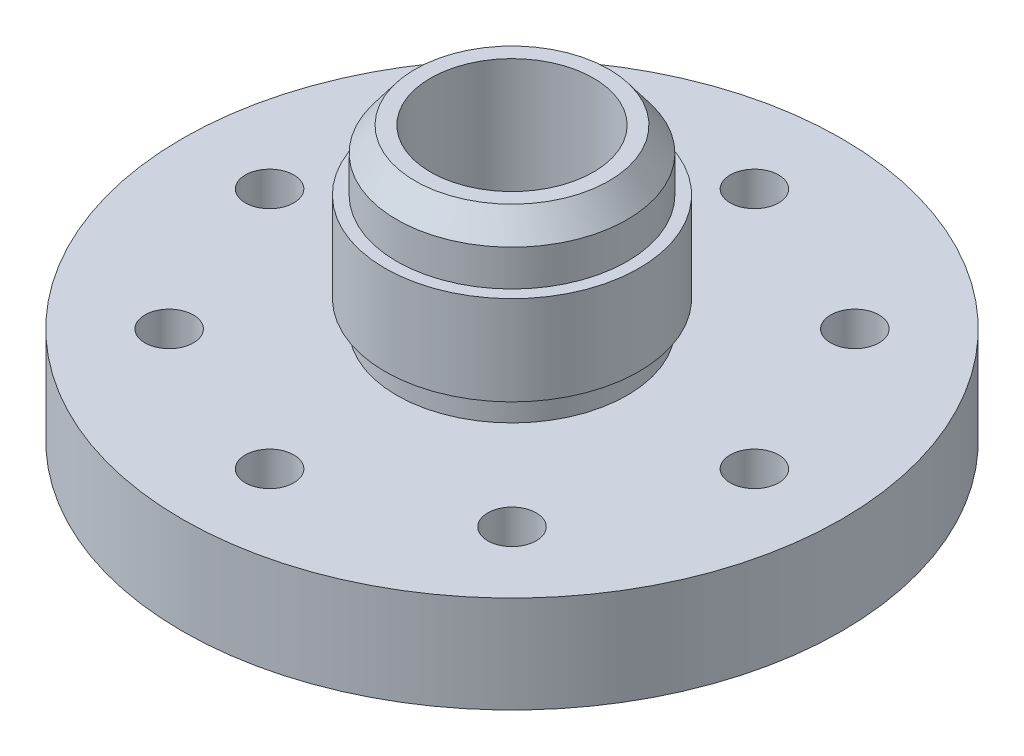
ISO-10303-21;
HEADER;
FILE_DESCRIPTION(('STEP AP214'),'2;1');
FILE_NAME('part.step','',(''),(''),'','','');
FILE_SCHEMA(('AUTOMOTIVE_DESIGN { 1 0 10303 214 1 1 1 1 }'));
ENDSEC;
DATA;
#1=APPLICATION_CONTEXT('core data for automotive mechanical design processes');
#2=APPLICATION_PROTOCOL_DEFINITION('international standard','automotive_design',2000,#1);
#3=PRODUCT_CONTEXT('',#1,'mechanical');
#4=PRODUCT('Part','Part','',(#3));
#5=PRODUCT_RELATED_PRODUCT_CATEGORY('part','',(#4));
#6=PRODUCT_DEFINITION_FORMATION('','',#4);
#7=PRODUCT_DEFINITION_CONTEXT('part definition',#1,'design');
#8=PRODUCT_DEFINITION('design','',#6,#7);
#9=PRODUCT_DEFINITION_SHAPE('','',#8);
#10=(LENGTH_UNIT() NAMED_UNIT(*) SI_UNIT(.MILLI.,.METRE.));
#11=(NAMED_UNIT(*) PLANE_ANGLE_UNIT() SI_UNIT($,.RADIAN.));
#12=(NAMED_UNIT(*) SI_UNIT($,.STERADIAN.) SOLID_ANGLE_UNIT());
#13=UNCERTAINTY_MEASURE_WITH_UNIT(LENGTH_MEASURE(1.E-05),#10,'distance_accuracy_value','');
#14=(GEOMETRIC_REPRESENTATION_CONTEXT(3) GLOBAL_UNCERTAINTY_ASSIGNED_CONTEXT((#13)) GLOBAL_UNIT_ASSIGNED_CONTEXT((#10,
#11,#12)) REPRESENTATION_CONTEXT('',''));
#15=CARTESIAN_POINT('',(0.,0.,0.));
#16=DIRECTION('',(0.,0.,1.));
#17=DIRECTION('',(1.,0.,0.));
#18=AXIS2_PLACEMENT_3D('',#15,#16,#17);
#19=CARTESIAN_POINT('',(0.,0.,0.));
#20=DIRECTION('',(0.,1.,0.));
#21=DIRECTION('',(0.,0.,1.));
#22=AXIS2_PLACEMENT_3D('',#19,#20,#21);
#23=PLANE('',#22);
#24=CARTESIAN_POINT('',(0.,0.,0.));
#25=DIRECTION('',(0.,1.,0.));
#26=DIRECTION('',(0.,0.,1.));
#27=AXIS2_PLACEMENT_3D('',#24,#25,#26);
#28=CIRCLE('',#27,10.668);
#29=CARTESIAN_POINT('',(0.,0.,10.668));
#30=VERTEX_POINT('',#29);
#31=EDGE_CURVE('E56',#30,#30,#28,.F.);
#32=ORIENTED_EDGE('',*,*,#31,.F.);
#33=EDGE_LOOP('',(#32));
#34=FACE_BOUND('',#33,.T.);
#35=CARTESIAN_POINT('',(0.,0.,0.));
#36=DIRECTION('',(0.,-1.,0.));
#37=DIRECTION('',(0.,0.,-1.));
#38=AXIS2_PLACEMENT_3D('',#35,#36,#37);
#39=CIRCLE('',#38,12.7);
#40=CARTESIAN_POINT('',(0.,0.,-12.7));
#41=VERTEX_POINT('',#40);
#42=EDGE_CURVE('E91',#41,#41,#39,.T.);
#43=ORIENTED_EDGE('',*,*,#42,.T.);
#44=EDGE_LOOP('',(#43));
#45=FACE_BOUND('',#44,.T.);
#46=ADVANCED_FACE('F37',(#34,#45),#23,.F.);
#47=CARTESIAN_POINT('',(0.,35.814,0.));
#48=DIRECTION('',(0.,1.,0.));
#49=DIRECTION('',(0.,0.,1.));
#50=AXIS2_PLACEMENT_3D('',#47,#48,#49);
#51=PLANE('',#50);
#52=CARTESIAN_POINT('',(0.,35.814,0.));
#53=DIRECTION('',(0.,1.,0.));
#54=DIRECTION('',(0.,0.,1.));
#55=AXIS2_PLACEMENT_3D('',#52,#53,#54);
#56=CIRCLE('',#55,10.668);
#57=CARTESIAN_POINT('',(0.,35.814,10.668));
#58=VERTEX_POINT('',#57);
#59=EDGE_CURVE('E62',#58,#58,#56,.T.);
#60=ORIENTED_EDGE('',*,*,#59,.F.);
#61=EDGE_LOOP('',(#60));
#62=FACE_BOUND('',#61,.T.);
#63=CARTESIAN_POINT('',(0.,35.814,0.));
#64=DIRECTION('',(0.,-1.,0.));
#65=DIRECTION('',(0.,0.,-1.));
#66=AXIS2_PLACEMENT_3D('',#63,#64,#65);
#67=CIRCLE('',#66,12.6873);
#68=CARTESIAN_POINT('',(0.,35.814,-12.6873));
#69=VERTEX_POINT('',#68);
#70=EDGE_CURVE('E81',#69,#69,#67,.T.);
#71=ORIENTED_EDGE('',*,*,#70,.F.);
#72=EDGE_LOOP('',(#71));
#73=FACE_BOUND('',#72,.T.);
#74=ADVANCED_FACE('F180',(#62,#73),#51,.T.);
#75=CARTESIAN_POINT('',(0.,35.814,0.));
#76=DIRECTION('',(0.,-1.,0.));
#77=DIRECTION('',(0.,0.,-1.));
#78=AXIS2_PLACEMENT_3D('',#75,#76,#77);
#79=CYLINDRICAL_SURFACE('',#78,15.0876);
#80=CARTESIAN_POINT('',(0.,12.7,0.));
#81=DIRECTION('',(0.,1.,0.));
#82=DIRECTION('',(0.,0.,1.));
#83=AXIS2_PLACEMENT_3D('',#80,#81,#82);
#84=CIRCLE('',#83,15.0876);
#85=CARTESIAN_POINT('',(0.,12.7,15.0876));
#86=VERTEX_POINT('',#85);
#87=EDGE_CURVE('E44',#86,#86,#84,.T.);
#88=ORIENTED_EDGE('',*,*,#87,.T.);
#89=EDGE_LOOP('',(#88));
#90=FACE_BOUND('',#89,.T.);
#91=CARTESIAN_POINT('',(0.,16.1798,0.));
#92=DIRECTION('',(0.,1.,0.));
#93=DIRECTION('',(0.,0.,1.));
#94=AXIS2_PLACEMENT_3D('',#91,#92,#93);
#95=CIRCLE('',#94,15.0876);
#96=CARTESIAN_POINT('',(0.,16.1798,15.0876));
#97=VERTEX_POINT('',#96);
#98=EDGE_CURVE('E10',#97,#97,#95,.T.);
#99=ORIENTED_EDGE('',*,*,#98,.F.);
#100=EDGE_LOOP('',(#99));
#101=FACE_BOUND('',#100,.T.);
#102=ADVANCED_FACE('F185',(#90,#101),#79,.T.);
#103=CARTESIAN_POINT('',(0.,12.7,0.));
#104=DIRECTION('',(0.,-1.,0.));
#105=DIRECTION('',(0.,0.,-1.));
#106=AXIS2_PLACEMENT_3D('',#103,#104,#105);
#107=CYLINDRICAL_SURFACE('',#106,43.18);
#108=CARTESIAN_POINT('',(0.,12.7,0.));
#109=DIRECTION('',(0.,1.,0.));
#110=DIRECTION('',(0.,0.,1.));
#111=AXIS2_PLACEMENT_3D('',#108,#109,#110);
#112=CIRCLE('',#111,43.18);
#113=CARTESIAN_POINT('',(0.,12.7,43.18));
#114=VERTEX_POINT('',#113);
#115=EDGE_CURVE('E48',#114,#114,#112,.T.);
#116=ORIENTED_EDGE('',*,*,#115,.F.);
#117=EDGE_LOOP('',(#116));
#118=FACE_BOUND('',#117,.T.);
#119=CARTESIAN_POINT('',(0.,0.,0.));
#120=DIRECTION('',(0.,1.,0.));
#121=DIRECTION('',(0.,0.,1.));
#122=AXIS2_PLACEMENT_3D('',#119,#120,#121);
#123=CIRCLE('',#122,43.18);
#124=CARTESIAN_POINT('',(0.,0.,43.18));
#125=VERTEX_POINT('',#124);
#126=EDGE_CURVE('E53',#125,#125,#123,.T.);
#127=ORIENTED_EDGE('',*,*,#126,.T.);
#128=EDGE_LOOP('',(#127));
#129=FACE_BOUND('',#128,.T.);
#130=ADVANCED_FACE('F39',(#118,#129),#107,.T.);
#131=CARTESIAN_POINT('',(0.,12.7,0.));
#132=DIRECTION('',(0.,1.,0.));
#133=DIRECTION('',(0.,0.,1.));
#134=AXIS2_PLACEMENT_3D('',#131,#132,#133);
#135=PLANE('',#134);
#136=CARTESIAN_POINT('',(31.75,12.7,-1.10854532508269E-13));
#137=DIRECTION('',(0.,1.,0.));
#138=DIRECTION('',(0.,0.,1.));
#139=AXIS2_PLACEMENT_3D('',#136,#137,#138);
#140=CIRCLE('',#139,3.175);
#141=CARTESIAN_POINT('',(31.75,12.7,3.17499999999989));
#142=VERTEX_POINT('',#141);
#143=EDGE_CURVE('E128',#142,#142,#140,.F.);
#144=ORIENTED_EDGE('',*,*,#143,.T.);
#145=EDGE_LOOP('',(#144));
#146=FACE_BOUND('',#145,.T.);
#147=CARTESIAN_POINT('',(22.4506403026728,12.7,-22.450640302673));
#148=DIRECTION('',(0.,1.,0.));
#149=DIRECTION('',(0.,0.,1.));
#150=AXIS2_PLACEMENT_3D('',#147,#148,#149);
#151=CIRCLE('',#150,3.175);
#152=CARTESIAN_POINT('',(22.4506403026728,12.7,-19.275640302673));
#153=VERTEX_POINT('',#152);
#154=EDGE_CURVE('E122',#153,#153,#151,.F.);
#155=ORIENTED_EDGE('',*,*,#154,.T.);
#156=EDGE_LOOP('',(#155));
#157=FACE_BOUND('',#156,.T.);
#158=CARTESIAN_POINT('',(0.,12.7,-31.75));
#159=DIRECTION('',(0.,1.,0.));
#160=DIRECTION('',(0.,0.,1.));
#161=AXIS2_PLACEMENT_3D('',#158,#159,#160);
#162=CIRCLE('',#161,3.175);
#163=CARTESIAN_POINT('',(0.,12.7,-28.575));
#164=VERTEX_POINT('',#163);
#165=EDGE_CURVE('E116',#164,#164,#162,.F.);
#166=ORIENTED_EDGE('',*,*,#165,.T.);
#167=EDGE_LOOP('',(#166));
#168=FACE_BOUND('',#167,.T.);
#169=CARTESIAN_POINT('',(-22.4506403026731,12.7,-22.4506403026727));
#170=DIRECTION('',(0.,1.,0.));
#171=DIRECTION('',(0.,0.,1.));
#172=AXIS2_PLACEMENT_3D('',#169,#170,#171);
#173=CIRCLE('',#172,3.175);
#174=CARTESIAN_POINT('',(-22.4506403026731,12.7,-19.2756403026727));
#175=VERTEX_POINT('',#174);
#176=EDGE_CURVE('E109',#175,#175,#173,.F.);
#177=ORIENTED_EDGE('',*,*,#176,.T.);
#178=EDGE_LOOP('',(#177));
#179=FACE_BOUND('',#178,.T.);
#180=CARTESIAN_POINT('',(-31.75,12.7,3.32563597524808E-13));
#181=DIRECTION('',(0.,1.,0.));
#182=DIRECTION('',(0.,0.,1.));
#183=AXIS2_PLACEMENT_3D('',#180,#181,#182);
#184=CIRCLE('',#183,3.175);
#185=CARTESIAN_POINT('',(-31.75,12.7,3.17500000000033));
#186=VERTEX_POINT('',#185);
#187=EDGE_CURVE('E139',#186,#186,#184,.F.);
#188=ORIENTED_EDGE('',*,*,#187,.T.);
#189=EDGE_LOOP('',(#188));
#190=FACE_BOUND('',#189,.T.);
#191=CARTESIAN_POINT('',(-22.4506403026726,12.7,22.4506403026732));
#192=DIRECTION('',(0.,1.,0.));
#193=DIRECTION('',(0.,0.,1.));
#194=AXIS2_PLACEMENT_3D('',#191,#192,#193);
#195=CIRCLE('',#194,3.175);
#196=CARTESIAN_POINT('',(-22.4506403026726,12.7,25.6256403026732));
#197=VERTEX_POINT('',#196);
#198=EDGE_CURVE('E133',#197,#197,#195,.F.);
#199=ORIENTED_EDGE('',*,*,#198,.T.);
#200=EDGE_LOOP('',(#199));
#201=FACE_BOUND('',#200,.T.);
#202=CARTESIAN_POINT('',(22.4506403026729,12.7,22.4506403026728));
#203=DIRECTION('',(0.,1.,0.));
#204=DIRECTION('',(0.,0.,1.));
#205=AXIS2_PLACEMENT_3D('',#202,#203,#204);
#206=CIRCLE('',#205,3.175);
#207=CARTESIAN_POINT('',(22.4506403026729,12.7,25.6256403026728));
#208=VERTEX_POINT('',#207);
#209=EDGE_CURVE('E103',#208,#208,#206,.F.);
#210=ORIENTED_EDGE('',*,*,#209,.T.);
#211=EDGE_LOOP('',(#210));
#212=FACE_BOUND('',#211,.T.);
#213=CARTESIAN_POINT('',(0.,12.7,31.75));
#214=DIRECTION('',(0.,1.,0.));
#215=DIRECTION('',(0.,0.,1.));
#216=AXIS2_PLACEMENT_3D('',#213,#214,#215);
#217=CIRCLE('',#216,3.175);
#218=CARTESIAN_POINT('',(0.,12.7,34.925));
#219=VERTEX_POINT('',#218);
#220=EDGE_CURVE('E97',#219,#219,#217,.F.);
#221=ORIENTED_EDGE('',*,*,#220,.T.);
#222=EDGE_LOOP('',(#221));
#223=FACE_BOUND('',#222,.T.);
#224=ORIENTED_EDGE('',*,*,#87,.F.);
#225=EDGE_LOOP('',(#224));
#226=FACE_BOUND('',#225,.T.);
#227=ORIENTED_EDGE('',*,*,#115,.T.);
#228=EDGE_LOOP('',(#227));
#229=FACE_BOUND('',#228,.T.);
#230=ADVANCED_FACE('F151',(#146,#157,#168,#179,#190,#201,#212,#223,#226,#229),#135,.T.);
#231=CARTESIAN_POINT('',(31.75,0.,-1.10854532508269E-13));
#232=DIRECTION('',(0.,-1.,0.));
#233=DIRECTION('',(-1.,0.,0.));
#234=AXIS2_PLACEMENT_3D('',#231,#232,#233);
#235=CIRCLE('',#234,3.175);
#236=CARTESIAN_POINT('',(28.575,0.,0.));
#237=VERTEX_POINT('',#236);
#238=EDGE_CURVE('E106',#237,#237,#235,.T.);
#239=ORIENTED_EDGE('',*,*,#238,.F.);
#240=EDGE_LOOP('',(#239));
#241=FACE_BOUND('',#240,.T.);
#242=CARTESIAN_POINT('',(22.4506403026728,0.,-22.450640302673));
#243=DIRECTION('',(0.,-1.,0.));
#244=DIRECTION('',(-0.707106781186544,0.,0.707106781186551));
#245=AXIS2_PLACEMENT_3D('',#242,#243,#244);
#246=CIRCLE('',#245,3.175);
#247=CARTESIAN_POINT('',(20.2055762724055,0.,-20.2055762724057));
#248=VERTEX_POINT('',#247);
#249=EDGE_CURVE('E125',#248,#248,#246,.T.);
#250=ORIENTED_EDGE('',*,*,#249,.F.);
#251=EDGE_LOOP('',(#250));
#252=FACE_BOUND('',#251,.T.);
#253=CARTESIAN_POINT('',(0.,0.,-31.75));
#254=DIRECTION('',(0.,-1.,0.));
#255=DIRECTION('',(0.,0.,1.));
#256=AXIS2_PLACEMENT_3D('',#253,#254,#255);
#257=CIRCLE('',#256,3.175);
#258=CARTESIAN_POINT('',(0.,0.,-28.575));
#259=VERTEX_POINT('',#258);
#260=EDGE_CURVE('E119',#259,#259,#257,.T.);
#261=ORIENTED_EDGE('',*,*,#260,.F.);
#262=EDGE_LOOP('',(#261));
#263=FACE_BOUND('',#262,.T.);
#264=CARTESIAN_POINT('',(-22.4506403026731,0.,-22.4506403026727));
#265=DIRECTION('',(0.,-1.,0.));
#266=DIRECTION('',(0.707106781186554,0.,0.707106781186541));
#267=AXIS2_PLACEMENT_3D('',#264,#265,#266);
#268=CIRCLE('',#267,3.175);
#269=CARTESIAN_POINT('',(-20.2055762724058,0.,-20.2055762724054));
#270=VERTEX_POINT('',#269);
#271=EDGE_CURVE('E112',#270,#270,#268,.T.);
#272=ORIENTED_EDGE('',*,*,#271,.F.);
#273=EDGE_LOOP('',(#272));
#274=FACE_BOUND('',#273,.T.);
#275=CARTESIAN_POINT('',(-31.75,0.,3.32563597524808E-13));
#276=DIRECTION('',(0.,-1.,0.));
#277=DIRECTION('',(1.,0.,0.));
#278=AXIS2_PLACEMENT_3D('',#275,#276,#277);
#279=CIRCLE('',#278,3.175);
#280=CARTESIAN_POINT('',(-28.575,0.,2.99307237772328E-13));
#281=VERTEX_POINT('',#280);
#282=EDGE_CURVE('E113',#281,#281,#279,.T.);
#283=ORIENTED_EDGE('',*,*,#282,.F.);
#284=EDGE_LOOP('',(#283));
#285=FACE_BOUND('',#284,.T.);
#286=CARTESIAN_POINT('',(-22.4506403026726,0.,22.4506403026732));
#287=DIRECTION('',(0.,-1.,0.));
#288=DIRECTION('',(0.707106781186539,0.,-0.707106781186556));
#289=AXIS2_PLACEMENT_3D('',#286,#287,#288);
#290=CIRCLE('',#289,3.175);
#291=CARTESIAN_POINT('',(-20.2055762724054,0.,20.2055762724058));
#292=VERTEX_POINT('',#291);
#293=EDGE_CURVE('E136',#292,#292,#290,.T.);
#294=ORIENTED_EDGE('',*,*,#293,.F.);
#295=EDGE_LOOP('',(#294));
#296=FACE_BOUND('',#295,.T.);
#297=CARTESIAN_POINT('',(22.4506403026729,0.,22.4506403026728));
#298=DIRECTION('',(0.,-1.,0.));
#299=DIRECTION('',(-0.707106781186549,0.,-0.707106781186546));
#300=AXIS2_PLACEMENT_3D('',#297,#298,#299);
#301=CIRCLE('',#300,3.175);
#302=CARTESIAN_POINT('',(20.2055762724056,0.,20.2055762724056));
#303=VERTEX_POINT('',#302);
#304=EDGE_CURVE('E100',#303,#303,#301,.T.);
#305=ORIENTED_EDGE('',*,*,#304,.F.);
#306=EDGE_LOOP('',(#305));
#307=FACE_BOUND('',#306,.T.);
#308=CARTESIAN_POINT('',(0.,0.,31.75));
#309=DIRECTION('',(0.,-1.,0.));
#310=DIRECTION('',(0.,0.,-1.));
#311=AXIS2_PLACEMENT_3D('',#308,#309,#310);
#312=CIRCLE('',#311,3.175);
#313=CARTESIAN_POINT('',(0.,0.,28.575));
#314=VERTEX_POINT('',#313);
#315=EDGE_CURVE('E94',#314,#314,#312,.T.);
#316=ORIENTED_EDGE('',*,*,#315,.F.);
#317=EDGE_LOOP('',(#316));
#318=FACE_BOUND('',#317,.T.);
#319=CARTESIAN_POINT('',(0.,0.,0.));
#320=DIRECTION('',(0.,-1.,0.));
#321=DIRECTION('',(0.,0.,-1.));
#322=AXIS2_PLACEMENT_3D('',#319,#320,#321);
#323=CIRCLE('',#322,15.1892);
#324=CARTESIAN_POINT('',(0.,0.,-15.1892));
#325=VERTEX_POINT('',#324);
#326=EDGE_CURVE('E85',#325,#325,#323,.T.);
#327=ORIENTED_EDGE('',*,*,#326,.F.);
#328=EDGE_LOOP('',(#327));
#329=FACE_BOUND('',#328,.T.);
#330=ORIENTED_EDGE('',*,*,#126,.F.);
#331=EDGE_LOOP('',(#330));
#332=FACE_BOUND('',#331,.T.);
#333=ADVANCED_FACE('F147',(#241,#252,#263,#274,#285,#296,#307,#318,#329,#332),#23,.F.);
#334=CARTESIAN_POINT('',(0.,32.6286943146645,0.));
#335=DIRECTION('',(0.,-1.,0.));
#336=DIRECTION('',(0.,0.,-1.));
#337=AXIS2_PLACEMENT_3D('',#334,#335,#336);
#338=CIRCLE('',#337,15.0876);
#339=CARTESIAN_POINT('',(0.,32.6286943146645,-15.0876));
#340=VERTEX_POINT('',#339);
#341=EDGE_CURVE('E78',#340,#340,#338,.T.);
#342=ORIENTED_EDGE('',*,*,#341,.T.);
#343=EDGE_LOOP('',(#342));
#344=FACE_BOUND('',#343,.T.);
#345=CARTESIAN_POINT('',(0.,27.8892,0.));
#346=DIRECTION('',(0.,1.,0.));
#347=DIRECTION('',(0.,0.,1.));
#348=AXIS2_PLACEMENT_3D('',#345,#346,#347);
#349=CIRCLE('',#348,15.0876);
#350=CARTESIAN_POINT('',(0.,27.8892,15.0876));
#351=VERTEX_POINT('',#350);
#352=EDGE_CURVE('E74',#351,#351,#349,.T.);
#353=ORIENTED_EDGE('',*,*,#352,.T.);
#354=EDGE_LOOP('',(#353));
#355=FACE_BOUND('',#354,.T.);
#356=ADVANCED_FACE('F150',(#344,#355),#79,.T.);
#357=CARTESIAN_POINT('',(0.,-0.001000000000001,0.));
#358=DIRECTION('',(0.,1.,0.));
#359=DIRECTION('',(0.,0.,1.));
#360=AXIS2_PLACEMENT_3D('',#357,#358,#359);
#361=CYLINDRICAL_SURFACE('',#360,10.668);
#362=ORIENTED_EDGE('',*,*,#59,.T.);
#363=EDGE_LOOP('',(#362));
#364=FACE_BOUND('',#363,.T.);
#365=ORIENTED_EDGE('',*,*,#31,.T.);
#366=EDGE_LOOP('',(#365));
#367=FACE_BOUND('',#366,.T.);
#368=ADVANCED_FACE('F194',(#364,#367),#361,.F.);
#369=CARTESIAN_POINT('',(0.,27.8892,0.));
#370=DIRECTION('',(0.,1.,0.));
#371=DIRECTION('',(0.,0.,1.));
#372=AXIS2_PLACEMENT_3D('',#369,#370,#371);
#373=PLANE('',#372);
#374=CARTESIAN_POINT('',(0.,27.8892,0.));
#375=DIRECTION('',(0.,1.,0.));
#376=DIRECTION('',(0.,0.,1.));
#377=AXIS2_PLACEMENT_3D('',#374,#375,#376);
#378=CIRCLE('',#377,16.637);
#379=CARTESIAN_POINT('',(0.,27.8892,16.637));
#380=VERTEX_POINT('',#379);
#381=EDGE_CURVE('E66',#380,#380,#378,.T.);
#382=ORIENTED_EDGE('',*,*,#381,.T.);
#383=EDGE_LOOP('',(#382));
#384=FACE_BOUND('',#383,.T.);
#385=ORIENTED_EDGE('',*,*,#352,.F.);
#386=EDGE_LOOP('',(#385));
#387=FACE_BOUND('',#386,.T.);
#388=ADVANCED_FACE('F199',(#384,#387),#373,.T.);
#389=CARTESIAN_POINT('',(0.,16.1798,0.));
#390=DIRECTION('',(0.,1.,0.));
#391=DIRECTION('',(0.,0.,1.));
#392=AXIS2_PLACEMENT_3D('',#389,#390,#391);
#393=PLANE('',#392);
#394=CARTESIAN_POINT('',(0.,16.1798,0.));
#395=DIRECTION('',(0.,1.,0.));
#396=DIRECTION('',(0.,0.,1.));
#397=AXIS2_PLACEMENT_3D('',#394,#395,#396);
#398=CIRCLE('',#397,16.637);
#399=CARTESIAN_POINT('',(0.,16.1798,16.637));
#400=VERTEX_POINT('',#399);
#401=EDGE_CURVE('E70',#400,#400,#398,.T.);
#402=ORIENTED_EDGE('',*,*,#401,.F.);
#403=EDGE_LOOP('',(#402));
#404=FACE_BOUND('',#403,.T.);
#405=ORIENTED_EDGE('',*,*,#98,.T.);
#406=EDGE_LOOP('',(#405));
#407=FACE_BOUND('',#406,.T.);
#408=ADVANCED_FACE('F202',(#404,#407),#393,.F.);
#409=CARTESIAN_POINT('',(0.,27.8892,0.));
#410=DIRECTION('',(0.,-1.,0.));
#411=DIRECTION('',(0.,0.,-1.));
#412=AXIS2_PLACEMENT_3D('',#409,#410,#411);
#413=CYLINDRICAL_SURFACE('',#412,16.637);
#414=ORIENTED_EDGE('',*,*,#381,.F.);
#415=EDGE_LOOP('',(#414));
#416=FACE_BOUND('',#415,.T.);
#417=ORIENTED_EDGE('',*,*,#401,.T.);
#418=EDGE_LOOP('',(#417));
#419=FACE_BOUND('',#418,.T.);
#420=ADVANCED_FACE('F176',(#416,#419),#413,.T.);
#421=CARTESIAN_POINT('',(0.,35.814,0.));
#422=DIRECTION('',(0.,-1.,0.));
#423=DIRECTION('',(0.,0.,-1.));
#424=AXIS2_PLACEMENT_3D('',#421,#422,#423);
#425=CONICAL_SURFACE('',#424,12.6873,0.645771823237896);
#426=ORIENTED_EDGE('',*,*,#341,.F.);
#427=EDGE_LOOP('',(#426));
#428=FACE_BOUND('',#427,.T.);
#429=ORIENTED_EDGE('',*,*,#70,.T.);
#430=EDGE_LOOP('',(#429));
#431=FACE_BOUND('',#430,.T.);
#432=ADVANCED_FACE('F165',(#428,#431),#425,.T.);
#433=CARTESIAN_POINT('',(0.,1.26238,0.));
#434=DIRECTION('',(0.,-1.,0.));
#435=DIRECTION('',(0.,0.,-1.));
#436=AXIS2_PLACEMENT_3D('',#433,#434,#435);
#437=CYLINDRICAL_SURFACE('',#436,15.1892);
#438=CARTESIAN_POINT('',(0.,1.26238,0.));
#439=DIRECTION('',(0.,-1.,0.));
#440=DIRECTION('',(0.,0.,-1.));
#441=AXIS2_PLACEMENT_3D('',#438,#439,#440);
#442=CIRCLE('',#441,15.1892);
#443=CARTESIAN_POINT('',(0.,1.26238,-15.1892));
#444=VERTEX_POINT('',#443);
#445=EDGE_CURVE('E84',#444,#444,#442,.T.);
#446=ORIENTED_EDGE('',*,*,#445,.F.);
#447=EDGE_LOOP('',(#446));
#448=FACE_BOUND('',#447,.T.);
#449=ORIENTED_EDGE('',*,*,#326,.T.);
#450=EDGE_LOOP('',(#449));
#451=FACE_BOUND('',#450,.T.);
#452=ADVANCED_FACE('F162',(#448,#451),#437,.F.);
#453=CARTESIAN_POINT('',(0.,1.26238,0.));
#454=DIRECTION('',(0.,-1.,0.));
#455=DIRECTION('',(0.,0.,-1.));
#456=AXIS2_PLACEMENT_3D('',#453,#454,#455);
#457=PLANE('',#456);
#458=CARTESIAN_POINT('',(0.,1.26238,0.));
#459=DIRECTION('',(0.,-1.,0.));
#460=DIRECTION('',(0.,0.,-1.));
#461=AXIS2_PLACEMENT_3D('',#458,#459,#460);
#462=CIRCLE('',#461,12.7);
#463=CARTESIAN_POINT('',(0.,1.26238,-12.7));
#464=VERTEX_POINT('',#463);
#465=EDGE_CURVE('E88',#464,#464,#462,.T.);
#466=ORIENTED_EDGE('',*,*,#465,.F.);
#467=EDGE_LOOP('',(#466));
#468=FACE_BOUND('',#467,.T.);
#469=ORIENTED_EDGE('',*,*,#445,.T.);
#470=EDGE_LOOP('',(#469));
#471=FACE_BOUND('',#470,.T.);
#472=ADVANCED_FACE('F164',(#468,#471),#457,.T.);
#473=CARTESIAN_POINT('',(0.,1.26238,0.));
#474=DIRECTION('',(0.,-1.,0.));
#475=DIRECTION('',(0.,0.,-1.));
#476=AXIS2_PLACEMENT_3D('',#473,#474,#475);
#477=CYLINDRICAL_SURFACE('',#476,12.7);
#478=ORIENTED_EDGE('',*,*,#465,.T.);
#479=EDGE_LOOP('',(#478));
#480=FACE_BOUND('',#479,.T.);
#481=ORIENTED_EDGE('',*,*,#42,.F.);
#482=EDGE_LOOP('',(#481));
#483=FACE_BOUND('',#482,.T.);
#484=ADVANCED_FACE('F172',(#480,#483),#477,.T.);
#485=CARTESIAN_POINT('',(0.,35.815,31.75));
#486=DIRECTION('',(0.,-1.,0.));
#487=DIRECTION('',(0.,0.,-1.));
#488=AXIS2_PLACEMENT_3D('',#485,#486,#487);
#489=CYLINDRICAL_SURFACE('',#488,3.175);
#490=ORIENTED_EDGE('',*,*,#220,.F.);
#491=EDGE_LOOP('',(#490));
#492=FACE_BOUND('',#491,.T.);
#493=ORIENTED_EDGE('',*,*,#315,.T.);
#494=EDGE_LOOP('',(#493));
#495=FACE_BOUND('',#494,.T.);
#496=ADVANCED_FACE('F273',(#492,#495),#489,.F.);
#497=CARTESIAN_POINT('',(22.4506403026729,35.815,22.4506403026728));
#498=DIRECTION('',(0.,-1.,0.));
#499=DIRECTION('',(0.,0.,-1.));
#500=AXIS2_PLACEMENT_3D('',#497,#498,#499);
#501=CYLINDRICAL_SURFACE('',#500,3.175);
#502=ORIENTED_EDGE('',*,*,#209,.F.);
#503=EDGE_LOOP('',(#502));
#504=FACE_BOUND('',#503,.T.);
#505=ORIENTED_EDGE('',*,*,#304,.T.);
#506=EDGE_LOOP('',(#505));
#507=FACE_BOUND('',#506,.T.);
#508=ADVANCED_FACE('F283',(#504,#507),#501,.F.);
#509=CARTESIAN_POINT('',(-22.4506403026726,35.815,22.4506403026732));
#510=DIRECTION('',(0.,-1.,0.));
#511=DIRECTION('',(0.,0.,-1.));
#512=AXIS2_PLACEMENT_3D('',#509,#510,#511);
#513=CYLINDRICAL_SURFACE('',#512,3.175);
#514=ORIENTED_EDGE('',*,*,#198,.F.);
#515=EDGE_LOOP('',(#514));
#516=FACE_BOUND('',#515,.T.);
#517=ORIENTED_EDGE('',*,*,#293,.T.);
#518=EDGE_LOOP('',(#517));
#519=FACE_BOUND('',#518,.T.);
#520=ADVANCED_FACE('F293',(#516,#519),#513,.F.);
#521=CARTESIAN_POINT('',(-31.75,35.815,3.32563597524808E-13));
#522=DIRECTION('',(0.,-1.,0.));
#523=DIRECTION('',(0.,0.,-1.));
#524=AXIS2_PLACEMENT_3D('',#521,#522,#523);
#525=CYLINDRICAL_SURFACE('',#524,3.175);
#526=ORIENTED_EDGE('',*,*,#187,.F.);
#527=EDGE_LOOP('',(#526));
#528=FACE_BOUND('',#527,.T.);
#529=ORIENTED_EDGE('',*,*,#282,.T.);
#530=EDGE_LOOP('',(#529));
#531=FACE_BOUND('',#530,.T.);
#532=ADVANCED_FACE('F145',(#528,#531),#525,.F.);
#533=CARTESIAN_POINT('',(-22.4506403026731,35.815,-22.4506403026727));
#534=DIRECTION('',(0.,-1.,0.));
#535=DIRECTION('',(0.,0.,-1.));
#536=AXIS2_PLACEMENT_3D('',#533,#534,#535);
#537=CYLINDRICAL_SURFACE('',#536,3.175);
#538=ORIENTED_EDGE('',*,*,#176,.F.);
#539=EDGE_LOOP('',(#538));
#540=FACE_BOUND('',#539,.T.);
#541=ORIENTED_EDGE('',*,*,#271,.T.);
#542=EDGE_LOOP('',(#541));
#543=FACE_BOUND('',#542,.T.);
#544=ADVANCED_FACE('F312',(#540,#543),#537,.F.);
#545=CARTESIAN_POINT('',(0.,35.815,-31.75));
#546=DIRECTION('',(0.,-1.,0.));
#547=DIRECTION('',(0.,0.,-1.));
#548=AXIS2_PLACEMENT_3D('',#545,#546,#547);
#549=CYLINDRICAL_SURFACE('',#548,3.175);
#550=ORIENTED_EDGE('',*,*,#165,.F.);
#551=EDGE_LOOP('',(#550));
#552=FACE_BOUND('',#551,.T.);
#553=ORIENTED_EDGE('',*,*,#260,.T.);
#554=EDGE_LOOP('',(#553));
#555=FACE_BOUND('',#554,.T.);
#556=ADVANCED_FACE('F322',(#552,#555),#549,.F.);
#557=CARTESIAN_POINT('',(22.4506403026728,35.815,-22.450640302673));
#558=DIRECTION('',(0.,-1.,0.));
#559=DIRECTION('',(0.,0.,-1.));
#560=AXIS2_PLACEMENT_3D('',#557,#558,#559);
#561=CYLINDRICAL_SURFACE('',#560,3.175);
#562=ORIENTED_EDGE('',*,*,#154,.F.);
#563=EDGE_LOOP('',(#562));
#564=FACE_BOUND('',#563,.T.);
#565=ORIENTED_EDGE('',*,*,#249,.T.);
#566=EDGE_LOOP('',(#565));
#567=FACE_BOUND('',#566,.T.);
#568=ADVANCED_FACE('F332',(#564,#567),#561,.F.);
#569=CARTESIAN_POINT('',(31.75,35.815,-1.10854532508269E-13));
#570=DIRECTION('',(0.,-1.,0.));
#571=DIRECTION('',(0.,0.,-1.));
#572=AXIS2_PLACEMENT_3D('',#569,#570,#571);
#573=CYLINDRICAL_SURFACE('',#572,3.175);
#574=ORIENTED_EDGE('',*,*,#143,.F.);
#575=EDGE_LOOP('',(#574));
#576=FACE_BOUND('',#575,.T.);
#577=ORIENTED_EDGE('',*,*,#238,.T.);
#578=EDGE_LOOP('',(#577));
#579=FACE_BOUND('',#578,.T.);
#580=ADVANCED_FACE('F342',(#576,#579),#573,.F.);
#581=CLOSED_SHELL('',(#46,#74,#102,#130,#230,#333,#356,#368,#388,#408,#420,#432,#452,#472,#484,
#496,#508,#520,#532,#544,#556,#568,#580));
#582=MANIFOLD_SOLID_BREP('B2',#581);
#583=ADVANCED_BREP_SHAPE_REPRESENTATION('',(#18,#582),#14);
#584=SHAPE_DEFINITION_REPRESENTATION(#9,#583);
ENDSEC;
END-ISO-10303-21;
